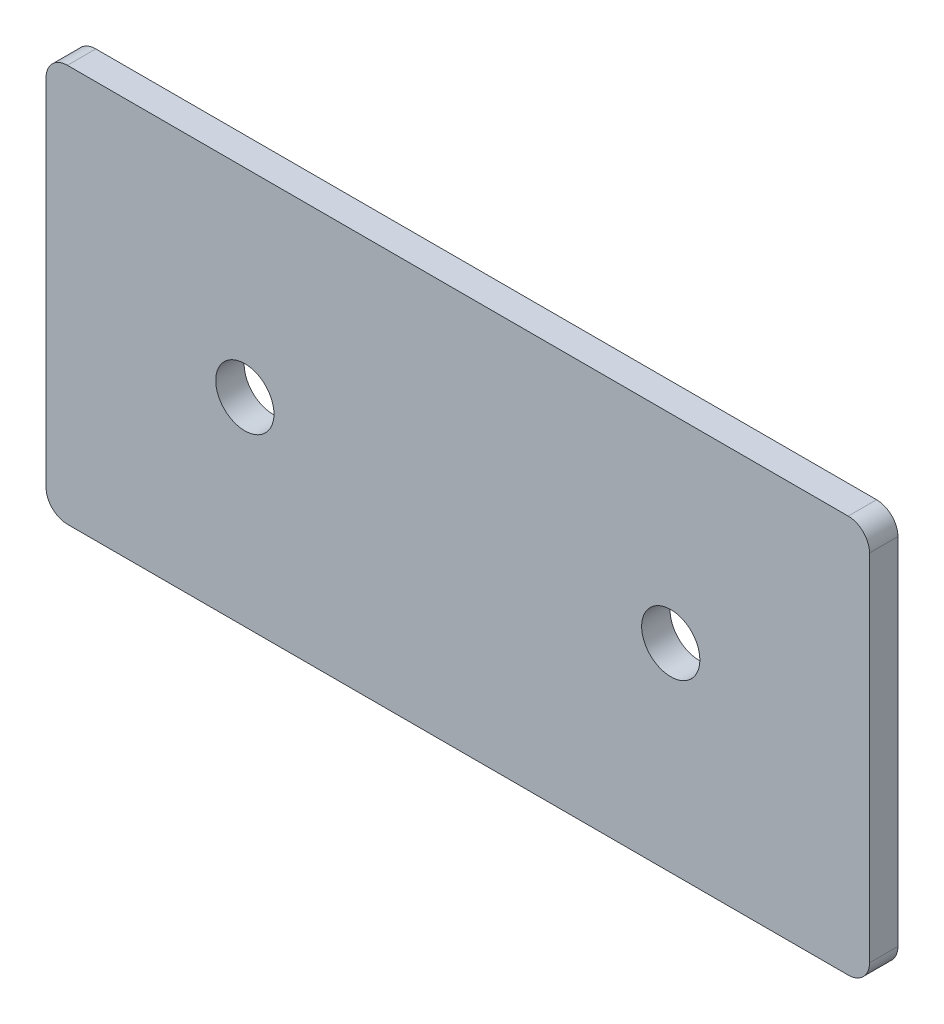
ISO-10303-21;
HEADER;
FILE_DESCRIPTION(('STEP AP214'),'2;1');
FILE_NAME('part.step','',(''),(''),'','','');
FILE_SCHEMA(('AUTOMOTIVE_DESIGN { 1 0 10303 214 1 1 1 1 }'));
ENDSEC;
DATA;
#1=APPLICATION_CONTEXT('core data for automotive mechanical design processes');
#2=APPLICATION_PROTOCOL_DEFINITION('international standard','automotive_design',2000,#1);
#3=PRODUCT_CONTEXT('',#1,'mechanical');
#4=PRODUCT('Part','Part','',(#3));
#5=PRODUCT_RELATED_PRODUCT_CATEGORY('part','',(#4));
#6=PRODUCT_DEFINITION_FORMATION('','',#4);
#7=PRODUCT_DEFINITION_CONTEXT('part definition',#1,'design');
#8=PRODUCT_DEFINITION('design','',#6,#7);
#9=PRODUCT_DEFINITION_SHAPE('','',#8);
#10=(LENGTH_UNIT() NAMED_UNIT(*) SI_UNIT(.MILLI.,.METRE.));
#11=(NAMED_UNIT(*) PLANE_ANGLE_UNIT() SI_UNIT($,.RADIAN.));
#12=(NAMED_UNIT(*) SI_UNIT($,.STERADIAN.) SOLID_ANGLE_UNIT());
#13=UNCERTAINTY_MEASURE_WITH_UNIT(LENGTH_MEASURE(1.E-05),#10,'distance_accuracy_value','');
#14=(GEOMETRIC_REPRESENTATION_CONTEXT(3) GLOBAL_UNCERTAINTY_ASSIGNED_CONTEXT((#13)) GLOBAL_UNIT_ASSIGNED_CONTEXT((#10,
#11,#12)) REPRESENTATION_CONTEXT('',''));
#15=CARTESIAN_POINT('',(0.,0.,0.));
#16=DIRECTION('',(0.,0.,1.));
#17=DIRECTION('',(1.,0.,0.));
#18=AXIS2_PLACEMENT_3D('',#15,#16,#17);
#19=CARTESIAN_POINT('',(0.,0.,4.));
#20=DIRECTION('',(0.,0.,1.));
#21=DIRECTION('',(1.,0.,0.));
#22=AXIS2_PLACEMENT_3D('',#19,#20,#21);
#23=PLANE('',#22);
#24=CARTESIAN_POINT('',(0.,0.,4.));
#25=DIRECTION('',(0.,0.,1.));
#26=DIRECTION('',(1.,0.,0.));
#27=AXIS2_PLACEMENT_3D('',#24,#25,#26);
#28=CIRCLE('',#27,4.1);
#29=CARTESIAN_POINT('',(4.1,0.,4.));
#30=VERTEX_POINT('',#29);
#31=EDGE_CURVE('E114',#30,#30,#28,.T.);
#32=ORIENTED_EDGE('',*,*,#31,.F.);
#33=EDGE_LOOP('',(#32));
#34=FACE_BOUND('',#33,.T.);
#35=DIRECTION('',(0.,-1.,0.));
#36=VECTOR('',#35,1.);
#37=CARTESIAN_POINT('',(-28.,28.,4.));
#38=LINE('',#37,#36);
#39=CARTESIAN_POINT('',(-28.,25.,4.));
#40=VERTEX_POINT('',#39);
#41=CARTESIAN_POINT('',(-28.,-25.,4.));
#42=VERTEX_POINT('',#41);
#43=EDGE_CURVE('E119',#40,#42,#38,.T.);
#44=ORIENTED_EDGE('',*,*,#43,.T.);
#45=CARTESIAN_POINT('',(-25.,-25.,4.));
#46=DIRECTION('',(0.,0.,1.));
#47=DIRECTION('',(1.,0.,0.));
#48=AXIS2_PLACEMENT_3D('',#45,#46,#47);
#49=CIRCLE('',#48,3.);
#50=CARTESIAN_POINT('',(-25.,-28.,4.));
#51=VERTEX_POINT('',#50);
#52=EDGE_CURVE('E134',#42,#51,#49,.T.);
#53=ORIENTED_EDGE('',*,*,#52,.T.);
#54=DIRECTION('',(1.,0.,0.));
#55=VECTOR('',#54,1.);
#56=CARTESIAN_POINT('',(-28.,-28.,4.));
#57=LINE('',#56,#55);
#58=CARTESIAN_POINT('',(85.,-28.,4.));
#59=VERTEX_POINT('',#58);
#60=EDGE_CURVE('E101',#51,#59,#57,.T.);
#61=ORIENTED_EDGE('',*,*,#60,.T.);
#62=CARTESIAN_POINT('',(85.,-25.,4.));
#63=DIRECTION('',(0.,0.,1.));
#64=DIRECTION('',(1.,0.,0.));
#65=AXIS2_PLACEMENT_3D('',#62,#63,#64);
#66=CIRCLE('',#65,3.);
#67=CARTESIAN_POINT('',(88.,-25.,4.));
#68=VERTEX_POINT('',#67);
#69=EDGE_CURVE('E132',#59,#68,#66,.T.);
#70=ORIENTED_EDGE('',*,*,#69,.T.);
#71=DIRECTION('',(0.,1.,0.));
#72=VECTOR('',#71,1.);
#73=CARTESIAN_POINT('',(88.,28.,4.));
#74=LINE('',#73,#72);
#75=CARTESIAN_POINT('',(88.,25.,4.));
#76=VERTEX_POINT('',#75);
#77=EDGE_CURVE('E145',#68,#76,#74,.T.);
#78=ORIENTED_EDGE('',*,*,#77,.T.);
#79=CARTESIAN_POINT('',(85.,25.,4.));
#80=DIRECTION('',(0.,0.,1.));
#81=DIRECTION('',(1.,0.,0.));
#82=AXIS2_PLACEMENT_3D('',#79,#80,#81);
#83=CIRCLE('',#82,3.);
#84=CARTESIAN_POINT('',(85.,28.,4.));
#85=VERTEX_POINT('',#84);
#86=EDGE_CURVE('E36',#76,#85,#83,.T.);
#87=ORIENTED_EDGE('',*,*,#86,.T.);
#88=DIRECTION('',(-1.,0.,0.));
#89=VECTOR('',#88,1.);
#90=CARTESIAN_POINT('',(-28.,28.,4.));
#91=LINE('',#90,#89);
#92=CARTESIAN_POINT('',(-25.,28.,4.));
#93=VERTEX_POINT('',#92);
#94=EDGE_CURVE('E120',#85,#93,#91,.T.);
#95=ORIENTED_EDGE('',*,*,#94,.T.);
#96=CARTESIAN_POINT('',(-25.,25.,4.));
#97=DIRECTION('',(0.,0.,1.));
#98=DIRECTION('',(1.,0.,0.));
#99=AXIS2_PLACEMENT_3D('',#96,#97,#98);
#100=CIRCLE('',#99,3.);
#101=EDGE_CURVE('E129',#93,#40,#100,.T.);
#102=ORIENTED_EDGE('',*,*,#101,.T.);
#103=EDGE_LOOP('',(#44,#53,#61,#70,#78,#87,#95,#102));
#104=FACE_BOUND('',#103,.T.);
#105=CARTESIAN_POINT('',(60.,0.,4.));
#106=DIRECTION('',(0.,0.,1.));
#107=DIRECTION('',(1.,0.,0.));
#108=AXIS2_PLACEMENT_3D('',#105,#106,#107);
#109=CIRCLE('',#108,4.09999999999999);
#110=CARTESIAN_POINT('',(64.1,0.,4.));
#111=VERTEX_POINT('',#110);
#112=EDGE_CURVE('E162',#111,#111,#109,.T.);
#113=ORIENTED_EDGE('',*,*,#112,.F.);
#114=EDGE_LOOP('',(#113));
#115=FACE_BOUND('',#114,.T.);
#116=ADVANCED_FACE('F15',(#34,#104,#115),#23,.T.);
#117=CARTESIAN_POINT('',(0.,0.,0.));
#118=DIRECTION('',(0.,0.,1.));
#119=DIRECTION('',(1.,0.,0.));
#120=AXIS2_PLACEMENT_3D('',#117,#118,#119);
#121=PLANE('',#120);
#122=DIRECTION('',(1.,0.,0.));
#123=VECTOR('',#122,1.);
#124=CARTESIAN_POINT('',(-28.,-28.,0.));
#125=LINE('',#124,#123);
#126=CARTESIAN_POINT('',(-25.,-28.,0.));
#127=VERTEX_POINT('',#126);
#128=CARTESIAN_POINT('',(85.,-28.,0.));
#129=VERTEX_POINT('',#128);
#130=EDGE_CURVE('E98',#127,#129,#125,.T.);
#131=ORIENTED_EDGE('',*,*,#130,.F.);
#132=CARTESIAN_POINT('',(-25.,-25.,0.));
#133=DIRECTION('',(0.,0.,1.));
#134=DIRECTION('',(1.,0.,0.));
#135=AXIS2_PLACEMENT_3D('',#132,#133,#134);
#136=CIRCLE('',#135,3.);
#137=CARTESIAN_POINT('',(-28.,-25.,0.));
#138=VERTEX_POINT('',#137);
#139=EDGE_CURVE('E81',#127,#138,#136,.F.);
#140=ORIENTED_EDGE('',*,*,#139,.T.);
#141=DIRECTION('',(0.,-1.,0.));
#142=VECTOR('',#141,1.);
#143=CARTESIAN_POINT('',(-28.,28.,0.));
#144=LINE('',#143,#142);
#145=CARTESIAN_POINT('',(-28.,25.,0.));
#146=VERTEX_POINT('',#145);
#147=EDGE_CURVE('E109',#146,#138,#144,.T.);
#148=ORIENTED_EDGE('',*,*,#147,.F.);
#149=CARTESIAN_POINT('',(-25.,25.,0.));
#150=DIRECTION('',(0.,0.,1.));
#151=DIRECTION('',(1.,0.,0.));
#152=AXIS2_PLACEMENT_3D('',#149,#150,#151);
#153=CIRCLE('',#152,3.);
#154=CARTESIAN_POINT('',(-25.,28.,0.));
#155=VERTEX_POINT('',#154);
#156=EDGE_CURVE('E102',#146,#155,#153,.F.);
#157=ORIENTED_EDGE('',*,*,#156,.T.);
#158=DIRECTION('',(-1.,0.,0.));
#159=VECTOR('',#158,1.);
#160=CARTESIAN_POINT('',(-28.,28.,0.));
#161=LINE('',#160,#159);
#162=CARTESIAN_POINT('',(85.,28.,0.));
#163=VERTEX_POINT('',#162);
#164=EDGE_CURVE('E112',#163,#155,#161,.T.);
#165=ORIENTED_EDGE('',*,*,#164,.F.);
#166=CARTESIAN_POINT('',(85.,25.,0.));
#167=DIRECTION('',(0.,0.,1.));
#168=DIRECTION('',(1.,0.,0.));
#169=AXIS2_PLACEMENT_3D('',#166,#167,#168);
#170=CIRCLE('',#169,3.);
#171=CARTESIAN_POINT('',(88.,25.,0.));
#172=VERTEX_POINT('',#171);
#173=EDGE_CURVE('E123',#163,#172,#170,.F.);
#174=ORIENTED_EDGE('',*,*,#173,.T.);
#175=DIRECTION('',(0.,1.,0.));
#176=VECTOR('',#175,1.);
#177=CARTESIAN_POINT('',(88.,28.,0.));
#178=LINE('',#177,#176);
#179=CARTESIAN_POINT('',(88.,-25.,0.));
#180=VERTEX_POINT('',#179);
#181=EDGE_CURVE('E108',#180,#172,#178,.T.);
#182=ORIENTED_EDGE('',*,*,#181,.F.);
#183=CARTESIAN_POINT('',(85.,-25.,0.));
#184=DIRECTION('',(0.,0.,1.));
#185=DIRECTION('',(1.,0.,0.));
#186=AXIS2_PLACEMENT_3D('',#183,#184,#185);
#187=CIRCLE('',#186,3.);
#188=EDGE_CURVE('E92',#180,#129,#187,.F.);
#189=ORIENTED_EDGE('',*,*,#188,.T.);
#190=EDGE_LOOP('',(#131,#140,#148,#157,#165,#174,#182,#189));
#191=FACE_BOUND('',#190,.T.);
#192=CARTESIAN_POINT('',(0.,0.,0.));
#193=DIRECTION('',(0.,0.,1.));
#194=DIRECTION('',(1.,0.,0.));
#195=AXIS2_PLACEMENT_3D('',#192,#193,#194);
#196=CIRCLE('',#195,4.1);
#197=CARTESIAN_POINT('',(4.1,0.,0.));
#198=VERTEX_POINT('',#197);
#199=EDGE_CURVE('E159',#198,#198,#196,.T.);
#200=ORIENTED_EDGE('',*,*,#199,.T.);
#201=EDGE_LOOP('',(#200));
#202=FACE_BOUND('',#201,.T.);
#203=CARTESIAN_POINT('',(60.,0.,0.));
#204=DIRECTION('',(0.,0.,1.));
#205=DIRECTION('',(1.,0.,0.));
#206=AXIS2_PLACEMENT_3D('',#203,#204,#205);
#207=CIRCLE('',#206,4.09999999999999);
#208=CARTESIAN_POINT('',(64.1,0.,0.));
#209=VERTEX_POINT('',#208);
#210=EDGE_CURVE('E165',#209,#209,#207,.T.);
#211=ORIENTED_EDGE('',*,*,#210,.T.);
#212=EDGE_LOOP('',(#211));
#213=FACE_BOUND('',#212,.T.);
#214=ADVANCED_FACE('F105',(#191,#202,#213),#121,.F.);
#215=CARTESIAN_POINT('',(-28.,28.,4.));
#216=DIRECTION('',(1.,0.,0.));
#217=DIRECTION('',(0.,1.,0.));
#218=AXIS2_PLACEMENT_3D('',#215,#216,#217);
#219=PLANE('',#218);
#220=ORIENTED_EDGE('',*,*,#147,.T.);
#221=DIRECTION('',(0.,0.,-1.));
#222=VECTOR('',#221,1.);
#223=CARTESIAN_POINT('',(-28.,-25.,4.));
#224=LINE('',#223,#222);
#225=EDGE_CURVE('E86',#138,#42,#224,.F.);
#226=ORIENTED_EDGE('',*,*,#225,.T.);
#227=ORIENTED_EDGE('',*,*,#43,.F.);
#228=DIRECTION('',(0.,0.,-1.));
#229=VECTOR('',#228,1.);
#230=CARTESIAN_POINT('',(-28.,25.,4.));
#231=LINE('',#230,#229);
#232=EDGE_CURVE('E91',#40,#146,#231,.T.);
#233=ORIENTED_EDGE('',*,*,#232,.T.);
#234=EDGE_LOOP('',(#220,#226,#227,#233));
#235=FACE_BOUND('',#234,.T.);
#236=ADVANCED_FACE('F181',(#235),#219,.F.);
#237=CARTESIAN_POINT('',(-28.,-28.,4.));
#238=DIRECTION('',(0.,1.,0.));
#239=DIRECTION('',(-1.,0.,0.));
#240=AXIS2_PLACEMENT_3D('',#237,#238,#239);
#241=PLANE('',#240);
#242=ORIENTED_EDGE('',*,*,#60,.F.);
#243=DIRECTION('',(0.,0.,-1.));
#244=VECTOR('',#243,1.);
#245=CARTESIAN_POINT('',(-25.,-28.,4.));
#246=LINE('',#245,#244);
#247=EDGE_CURVE('E85',#51,#127,#246,.T.);
#248=ORIENTED_EDGE('',*,*,#247,.T.);
#249=ORIENTED_EDGE('',*,*,#130,.T.);
#250=DIRECTION('',(0.,0.,-1.));
#251=VECTOR('',#250,1.);
#252=CARTESIAN_POINT('',(85.,-28.,4.));
#253=LINE('',#252,#251);
#254=EDGE_CURVE('E103',#129,#59,#253,.F.);
#255=ORIENTED_EDGE('',*,*,#254,.T.);
#256=EDGE_LOOP('',(#242,#248,#249,#255));
#257=FACE_BOUND('',#256,.T.);
#258=ADVANCED_FACE('F97',(#257),#241,.F.);
#259=CARTESIAN_POINT('',(88.,28.,4.));
#260=DIRECTION('',(-1.,0.,0.));
#261=DIRECTION('',(0.,0.,1.));
#262=AXIS2_PLACEMENT_3D('',#259,#260,#261);
#263=PLANE('',#262);
#264=ORIENTED_EDGE('',*,*,#77,.F.);
#265=DIRECTION('',(0.,0.,-1.));
#266=VECTOR('',#265,1.);
#267=CARTESIAN_POINT('',(88.,-25.,4.));
#268=LINE('',#267,#266);
#269=EDGE_CURVE('E138',#68,#180,#268,.T.);
#270=ORIENTED_EDGE('',*,*,#269,.T.);
#271=ORIENTED_EDGE('',*,*,#181,.T.);
#272=DIRECTION('',(0.,0.,-1.));
#273=VECTOR('',#272,1.);
#274=CARTESIAN_POINT('',(88.,25.,4.));
#275=LINE('',#274,#273);
#276=EDGE_CURVE('E136',#172,#76,#275,.F.);
#277=ORIENTED_EDGE('',*,*,#276,.T.);
#278=EDGE_LOOP('',(#264,#270,#271,#277));
#279=FACE_BOUND('',#278,.T.);
#280=ADVANCED_FACE('F143',(#279),#263,.F.);
#281=CARTESIAN_POINT('',(-28.,28.,4.));
#282=DIRECTION('',(0.,-1.,0.));
#283=DIRECTION('',(1.,0.,0.));
#284=AXIS2_PLACEMENT_3D('',#281,#282,#283);
#285=PLANE('',#284);
#286=ORIENTED_EDGE('',*,*,#94,.F.);
#287=DIRECTION('',(0.,0.,-1.));
#288=VECTOR('',#287,1.);
#289=CARTESIAN_POINT('',(85.,28.,4.));
#290=LINE('',#289,#288);
#291=EDGE_CURVE('E9',#85,#163,#290,.T.);
#292=ORIENTED_EDGE('',*,*,#291,.T.);
#293=ORIENTED_EDGE('',*,*,#164,.T.);
#294=DIRECTION('',(0.,0.,-1.));
#295=VECTOR('',#294,1.);
#296=CARTESIAN_POINT('',(-25.,28.,4.));
#297=LINE('',#296,#295);
#298=EDGE_CURVE('E23',#155,#93,#297,.F.);
#299=ORIENTED_EDGE('',*,*,#298,.T.);
#300=EDGE_LOOP('',(#286,#292,#293,#299));
#301=FACE_BOUND('',#300,.T.);
#302=ADVANCED_FACE('F152',(#301),#285,.F.);
#303=CARTESIAN_POINT('',(0.,0.,4.));
#304=DIRECTION('',(0.,0.,-1.));
#305=DIRECTION('',(-1.,0.,0.));
#306=AXIS2_PLACEMENT_3D('',#303,#304,#305);
#307=CYLINDRICAL_SURFACE('',#306,4.1);
#308=ORIENTED_EDGE('',*,*,#31,.T.);
#309=EDGE_LOOP('',(#308));
#310=FACE_BOUND('',#309,.T.);
#311=ORIENTED_EDGE('',*,*,#199,.F.);
#312=EDGE_LOOP('',(#311));
#313=FACE_BOUND('',#312,.T.);
#314=ADVANCED_FACE('F185',(#310,#313),#307,.F.);
#315=CARTESIAN_POINT('',(60.,0.,4.));
#316=DIRECTION('',(0.,0.,-1.));
#317=DIRECTION('',(-1.,0.,0.));
#318=AXIS2_PLACEMENT_3D('',#315,#316,#317);
#319=CYLINDRICAL_SURFACE('',#318,4.09999999999999);
#320=ORIENTED_EDGE('',*,*,#112,.T.);
#321=EDGE_LOOP('',(#320));
#322=FACE_BOUND('',#321,.T.);
#323=ORIENTED_EDGE('',*,*,#210,.F.);
#324=EDGE_LOOP('',(#323));
#325=FACE_BOUND('',#324,.T.);
#326=ADVANCED_FACE('F171',(#322,#325),#319,.F.);
#327=CARTESIAN_POINT('',(-25.,-25.,4.));
#328=DIRECTION('',(0.,0.,-1.));
#329=DIRECTION('',(-1.,0.,0.));
#330=AXIS2_PLACEMENT_3D('',#327,#328,#329);
#331=CYLINDRICAL_SURFACE('',#330,3.);
#332=ORIENTED_EDGE('',*,*,#52,.F.);
#333=ORIENTED_EDGE('',*,*,#225,.F.);
#334=ORIENTED_EDGE('',*,*,#139,.F.);
#335=ORIENTED_EDGE('',*,*,#247,.F.);
#336=EDGE_LOOP('',(#332,#333,#334,#335));
#337=FACE_BOUND('',#336,.T.);
#338=ADVANCED_FACE('F84',(#337),#331,.T.);
#339=CARTESIAN_POINT('',(85.,-25.,4.));
#340=DIRECTION('',(0.,0.,-1.));
#341=DIRECTION('',(-1.,0.,0.));
#342=AXIS2_PLACEMENT_3D('',#339,#340,#341);
#343=CYLINDRICAL_SURFACE('',#342,3.);
#344=ORIENTED_EDGE('',*,*,#69,.F.);
#345=ORIENTED_EDGE('',*,*,#254,.F.);
#346=ORIENTED_EDGE('',*,*,#188,.F.);
#347=ORIENTED_EDGE('',*,*,#269,.F.);
#348=EDGE_LOOP('',(#344,#345,#346,#347));
#349=FACE_BOUND('',#348,.T.);
#350=ADVANCED_FACE('F199',(#349),#343,.T.);
#351=CARTESIAN_POINT('',(85.,25.,4.));
#352=DIRECTION('',(0.,0.,-1.));
#353=DIRECTION('',(-1.,0.,0.));
#354=AXIS2_PLACEMENT_3D('',#351,#352,#353);
#355=CYLINDRICAL_SURFACE('',#354,3.);
#356=ORIENTED_EDGE('',*,*,#86,.F.);
#357=ORIENTED_EDGE('',*,*,#276,.F.);
#358=ORIENTED_EDGE('',*,*,#173,.F.);
#359=ORIENTED_EDGE('',*,*,#291,.F.);
#360=EDGE_LOOP('',(#356,#357,#358,#359));
#361=FACE_BOUND('',#360,.T.);
#362=ADVANCED_FACE('F151',(#361),#355,.T.);
#363=CARTESIAN_POINT('',(-25.,25.,4.));
#364=DIRECTION('',(0.,0.,-1.));
#365=DIRECTION('',(-1.,0.,0.));
#366=AXIS2_PLACEMENT_3D('',#363,#364,#365);
#367=CYLINDRICAL_SURFACE('',#366,3.);
#368=ORIENTED_EDGE('',*,*,#101,.F.);
#369=ORIENTED_EDGE('',*,*,#298,.F.);
#370=ORIENTED_EDGE('',*,*,#156,.F.);
#371=ORIENTED_EDGE('',*,*,#232,.F.);
#372=EDGE_LOOP('',(#368,#369,#370,#371));
#373=FACE_BOUND('',#372,.T.);
#374=ADVANCED_FACE('F17',(#373),#367,.T.);
#375=CLOSED_SHELL('',(#116,#214,#236,#258,#280,#302,#314,#326,#338,#350,#362,#374));
#376=MANIFOLD_SOLID_BREP('B1',#375);
#377=ADVANCED_BREP_SHAPE_REPRESENTATION('',(#18,#376),#14);
#378=SHAPE_DEFINITION_REPRESENTATION(#9,#377);
ENDSEC;
END-ISO-10303-21;
